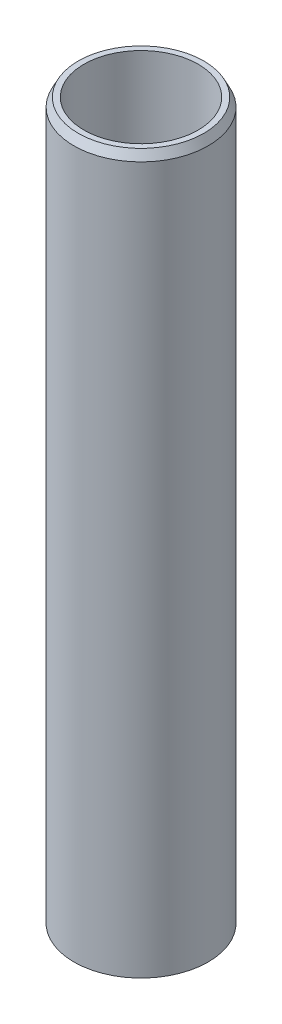
ISO-10303-21;
HEADER;
FILE_DESCRIPTION(('STEP AP214'),'2;1');
FILE_NAME('part.step','',(''),(''),'','','');
FILE_SCHEMA(('AUTOMOTIVE_DESIGN { 1 0 10303 214 1 1 1 1 }'));
ENDSEC;
DATA;
#1=APPLICATION_CONTEXT('core data for automotive mechanical design processes');
#2=APPLICATION_PROTOCOL_DEFINITION('international standard','automotive_design',2000,#1);
#3=PRODUCT_CONTEXT('',#1,'mechanical');
#4=PRODUCT('Part','Part','',(#3));
#5=PRODUCT_RELATED_PRODUCT_CATEGORY('part','',(#4));
#6=PRODUCT_DEFINITION_FORMATION('','',#4);
#7=PRODUCT_DEFINITION_CONTEXT('part definition',#1,'design');
#8=PRODUCT_DEFINITION('design','',#6,#7);
#9=PRODUCT_DEFINITION_SHAPE('','',#8);
#10=(LENGTH_UNIT() NAMED_UNIT(*) SI_UNIT(.MILLI.,.METRE.));
#11=(NAMED_UNIT(*) PLANE_ANGLE_UNIT() SI_UNIT($,.RADIAN.));
#12=(NAMED_UNIT(*) SI_UNIT($,.STERADIAN.) SOLID_ANGLE_UNIT());
#13=UNCERTAINTY_MEASURE_WITH_UNIT(LENGTH_MEASURE(1.E-05),#10,'distance_accuracy_value','');
#14=(GEOMETRIC_REPRESENTATION_CONTEXT(3) GLOBAL_UNCERTAINTY_ASSIGNED_CONTEXT((#13)) GLOBAL_UNIT_ASSIGNED_CONTEXT((#10,
#11,#12)) REPRESENTATION_CONTEXT('',''));
#15=CARTESIAN_POINT('',(0.,0.,0.));
#16=DIRECTION('',(0.,0.,1.));
#17=DIRECTION('',(1.,0.,0.));
#18=AXIS2_PLACEMENT_3D('',#15,#16,#17);
#19=CARTESIAN_POINT('',(0.,482.267406242049,0.));
#20=DIRECTION('',(0.,-1.,0.));
#21=DIRECTION('',(0.,0.,-1.));
#22=AXIS2_PLACEMENT_3D('',#19,#20,#21);
#23=CYLINDRICAL_SURFACE('',#22,45.);
#24=CARTESIAN_POINT('',(0.,476.4925328889,0.));
#25=DIRECTION('',(0.,1.,0.));
#26=DIRECTION('',(0.,0.,1.));
#27=AXIS2_PLACEMENT_3D('',#24,#25,#26);
#28=CIRCLE('',#27,45.);
#29=CARTESIAN_POINT('',(0.,476.4925328889,-45.));
#30=VERTEX_POINT('',#29);
#31=EDGE_CURVE('E50',#30,#30,#28,.F.);
#32=CARTESIAN_POINT('',(0.,2.95752745711164,0.));
#33=DIRECTION('',(0.,1.,0.));
#34=DIRECTION('',(0.,0.,1.));
#35=AXIS2_PLACEMENT_3D('',#32,#33,#34);
#36=CIRCLE('',#35,45.);
#37=CARTESIAN_POINT('',(0.,2.95752745711164,-45.));
#38=VERTEX_POINT('',#37);
#39=EDGE_CURVE('E51',#38,#38,#36,.T.);
#40=CARTESIAN_POINT('',(0.,476.4925328889,-45.));
#41=CARTESIAN_POINT('',(0.,471.559876582319,-45.));
#42=CARTESIAN_POINT('',(0.,466.627220275738,-45.));
#43=CARTESIAN_POINT('',(0.,456.761907662576,-45.));
#44=CARTESIAN_POINT('',(0.,451.829251355994,-45.));
#45=CARTESIAN_POINT('',(0.,441.963938742832,-45.));
#46=CARTESIAN_POINT('',(0.,437.031282436251,-45.));
#47=CARTESIAN_POINT('',(0.,427.165969823089,-45.));
#48=CARTESIAN_POINT('',(0.,422.233313516508,-45.));
#49=CARTESIAN_POINT('',(0.,412.368000903345,-45.));
#50=CARTESIAN_POINT('',(0.,407.435344596764,-45.));
#51=CARTESIAN_POINT('',(0.,397.570031983602,-45.));
#52=CARTESIAN_POINT('',(0.,392.637375677021,-45.));
#53=CARTESIAN_POINT('',(0.,382.772063063859,-45.));
#54=CARTESIAN_POINT('',(0.,377.839406757277,-45.));
#55=CARTESIAN_POINT('',(0.,367.974094144115,-45.));
#56=CARTESIAN_POINT('',(0.,363.041437837534,-45.));
#57=CARTESIAN_POINT('',(0.,353.176125224372,-45.));
#58=CARTESIAN_POINT('',(0.,348.243468917791,-45.));
#59=CARTESIAN_POINT('',(0.,338.378156304628,-45.));
#60=CARTESIAN_POINT('',(0.,333.445499998047,-45.));
#61=CARTESIAN_POINT('',(0.,323.580187384885,-45.));
#62=CARTESIAN_POINT('',(0.,318.647531078304,-45.));
#63=CARTESIAN_POINT('',(0.,308.782218465142,-45.));
#64=CARTESIAN_POINT('',(0.,303.849562158561,-45.));
#65=CARTESIAN_POINT('',(0.,293.984249545398,-45.));
#66=CARTESIAN_POINT('',(0.,289.051593238817,-45.));
#67=CARTESIAN_POINT('',(0.,279.186280625655,-45.));
#68=CARTESIAN_POINT('',(0.,274.253624319074,-45.));
#69=CARTESIAN_POINT('',(0.,264.388311705911,-45.));
#70=CARTESIAN_POINT('',(0.,259.45565539933,-45.));
#71=CARTESIAN_POINT('',(0.,249.590342786168,-45.));
#72=CARTESIAN_POINT('',(0.,244.657686479587,-45.));
#73=CARTESIAN_POINT('',(0.,234.792373866425,-45.));
#74=CARTESIAN_POINT('',(0.,229.859717559844,-45.));
#75=CARTESIAN_POINT('',(0.,219.994404946681,-45.));
#76=CARTESIAN_POINT('',(0.,215.0617486401,-45.));
#77=CARTESIAN_POINT('',(0.,205.196436026938,-45.));
#78=CARTESIAN_POINT('',(0.,200.263779720357,-45.));
#79=CARTESIAN_POINT('',(0.,190.398467107195,-45.));
#80=CARTESIAN_POINT('',(0.,185.465810800613,-45.));
#81=CARTESIAN_POINT('',(0.,175.600498187451,-45.));
#82=CARTESIAN_POINT('',(0.,170.66784188087,-45.));
#83=CARTESIAN_POINT('',(0.,160.802529267708,-45.));
#84=CARTESIAN_POINT('',(0.,155.869872961127,-45.));
#85=CARTESIAN_POINT('',(0.,146.004560347964,-45.));
#86=CARTESIAN_POINT('',(0.,141.071904041383,-45.));
#87=CARTESIAN_POINT('',(0.,131.206591428221,-45.));
#88=CARTESIAN_POINT('',(0.,126.27393512164,-45.));
#89=CARTESIAN_POINT('',(0.,116.408622508478,-45.));
#90=CARTESIAN_POINT('',(0.,111.475966201896,-45.));
#91=CARTESIAN_POINT('',(0.,101.610653588734,-45.));
#92=CARTESIAN_POINT('',(0.,96.6779972821531,-45.));
#93=CARTESIAN_POINT('',(0.,86.8126846689908,-45.));
#94=CARTESIAN_POINT('',(0.,81.8800283624097,-45.));
#95=CARTESIAN_POINT('',(0.,72.0147157492474,-45.));
#96=CARTESIAN_POINT('',(0.,67.0820594426663,-45.));
#97=CARTESIAN_POINT('',(0.,57.2167468295041,-45.));
#98=CARTESIAN_POINT('',(0.,52.2840905229229,-45.));
#99=CARTESIAN_POINT('',(0.,42.4187779097607,-45.));
#100=CARTESIAN_POINT('',(0.,37.4861216031795,-45.));
#101=CARTESIAN_POINT('',(0.,27.6208089900173,-45.));
#102=CARTESIAN_POINT('',(0.,22.6881526834362,-45.));
#103=CARTESIAN_POINT('',(0.,12.8228400702739,-45.));
#104=CARTESIAN_POINT('',(0.,7.89018376369277,-45.));
#105=CARTESIAN_POINT('',(0.,2.95752745711164,-45.));
#106=B_SPLINE_CURVE_WITH_KNOTS('',3,(#40,#41,#42,#43,#44,#45,#46,#47,#48,#49,#50,#51,#52,#53,
#54,#55,#56,#57,#58,#59,#60,#61,#62,#63,#64,#65,#66,#67,#68,#69,#70,#71,#72,#73,#74,#75,#76,#77,
#78,#79,#80,#81,#82,#83,#84,#85,#86,#87,#88,#89,#90,#91,#92,#93,#94,#95,#96,#97,#98,#99,#100,
#101,#102,#103,#104,#105),.UNSPECIFIED.,.F.,.F.,(4,2,2,2,2,2,2,2,2,2,2,2,2,2,2,2,2,2,2,2,2,2,2,
2,2,2,2,2,2,2,2,2,4),(0.,14.7979689197434,29.5959378394868,44.3939067592302,59.1918756789736,
73.989844598717,88.7878135184604,103.585782438204,118.383751357947,133.181720277691,
147.979689197434,162.777658117177,177.575627036921,192.373595956664,207.171564876407,
221.969533796151,236.767502715894,251.565471635638,266.363440555381,281.161409475124,
295.959378394868,310.757347314611,325.555316234355,340.353285154098,355.151254073841,
369.949222993585,384.747191913328,399.545160833072,414.343129752815,429.141098672558,
443.939067592302,458.737036512045,473.535005431788),.UNSPECIFIED.);
#107=EDGE_CURVE('BSEAM39',#30,#38,#106,.T.);
#108=ORIENTED_EDGE('',*,*,#31,.T.);
#109=ORIENTED_EDGE('',*,*,#39,.T.);
#110=ORIENTED_EDGE('',*,*,#107,.T.);
#111=ORIENTED_EDGE('',*,*,#107,.F.);
#112=EDGE_LOOP('',(#108,#110,#109,#111));
#113=FACE_BOUND('',#112,.T.);
#114=ADVANCED_FACE('F39',(#113),#23,.T.);
#115=CARTESIAN_POINT('',(0.,482.267406242049,0.));
#116=DIRECTION('',(0.,1.,0.));
#117=DIRECTION('',(0.,0.,1.));
#118=AXIS2_PLACEMENT_3D('',#115,#116,#117);
#119=PLANE('',#118);
#120=CARTESIAN_POINT('',(0.,482.267406242049,0.));
#121=DIRECTION('',(0.,1.,0.));
#122=DIRECTION('',(0.,0.,1.));
#123=AXIS2_PLACEMENT_3D('',#120,#121,#122);
#124=CIRCLE('',#123,42.0424725428887);
#125=CARTESIAN_POINT('',(0.,482.267406242049,42.0424725428887));
#126=VERTEX_POINT('',#125);
#127=EDGE_CURVE('E54',#126,#126,#124,.T.);
#128=ORIENTED_EDGE('',*,*,#127,.T.);
#129=EDGE_LOOP('',(#128));
#130=FACE_BOUND('',#129,.T.);
#131=CARTESIAN_POINT('',(0.,482.267406242049,0.));
#132=DIRECTION('',(0.,1.,0.));
#133=DIRECTION('',(0.,0.,1.));
#134=AXIS2_PLACEMENT_3D('',#131,#132,#133);
#135=CIRCLE('',#134,38.2643861408884);
#136=CARTESIAN_POINT('',(0.,482.267406242049,-38.2643861408884));
#137=VERTEX_POINT('',#136);
#138=EDGE_CURVE('E58',#137,#137,#135,.T.);
#139=ORIENTED_EDGE('',*,*,#138,.F.);
#140=EDGE_LOOP('',(#139));
#141=FACE_BOUND('',#140,.T.);
#142=ADVANCED_FACE('F69',(#130,#141),#119,.T.);
#143=CARTESIAN_POINT('',(0.,0.,0.));
#144=DIRECTION('',(0.,1.,0.));
#145=DIRECTION('',(0.,0.,1.));
#146=AXIS2_PLACEMENT_3D('',#143,#144,#145);
#147=PLANE('',#146);
#148=CARTESIAN_POINT('',(0.,0.,0.));
#149=DIRECTION('',(0.,1.,0.));
#150=DIRECTION('',(0.,0.,1.));
#151=AXIS2_PLACEMENT_3D('',#148,#149,#150);
#152=CIRCLE('',#151,39.2251266468508);
#153=CARTESIAN_POINT('',(0.,0.,39.2251266468508));
#154=VERTEX_POINT('',#153);
#155=EDGE_CURVE('E10',#154,#154,#152,.F.);
#156=ORIENTED_EDGE('',*,*,#155,.T.);
#157=EDGE_LOOP('',(#156));
#158=FACE_BOUND('',#157,.T.);
#159=CARTESIAN_POINT('',(0.,0.,0.));
#160=DIRECTION('',(0.,1.,0.));
#161=DIRECTION('',(0.,0.,1.));
#162=AXIS2_PLACEMENT_3D('',#159,#160,#161);
#163=CIRCLE('',#162,38.2643861408884);
#164=CARTESIAN_POINT('',(0.,0.,-38.2643861408884));
#165=VERTEX_POINT('',#164);
#166=EDGE_CURVE('E63',#165,#165,#163,.T.);
#167=ORIENTED_EDGE('',*,*,#166,.T.);
#168=EDGE_LOOP('',(#167));
#169=FACE_BOUND('',#168,.T.);
#170=ADVANCED_FACE('F75',(#158,#169),#147,.F.);
#171=CARTESIAN_POINT('',(0.,482.267406242049,0.));
#172=DIRECTION('',(0.,-1.,0.));
#173=DIRECTION('',(0.,0.,-1.));
#174=AXIS2_PLACEMENT_3D('',#171,#172,#173);
#175=CYLINDRICAL_SURFACE('',#174,38.2643861408884);
#176=CARTESIAN_POINT('',(0.,482.267406242049,-38.2643861408884));
#177=CARTESIAN_POINT('',(0.,477.243787427027,-38.2643861408884));
#178=CARTESIAN_POINT('',(0.,472.220168612006,-38.2643861408884));
#179=CARTESIAN_POINT('',(0.,462.172930981963,-38.2643861408884));
#180=CARTESIAN_POINT('',(0.,457.149312166942,-38.2643861408884));
#181=CARTESIAN_POINT('',(0.,447.102074536899,-38.2643861408884));
#182=CARTESIAN_POINT('',(0.,442.078455721878,-38.2643861408884));
#183=CARTESIAN_POINT('',(0.,432.031218091835,-38.2643861408884));
#184=CARTESIAN_POINT('',(0.,427.007599276814,-38.2643861408884));
#185=CARTESIAN_POINT('',(0.,416.960361646771,-38.2643861408884));
#186=CARTESIAN_POINT('',(0.,411.93674283175,-38.2643861408884));
#187=CARTESIAN_POINT('',(0.,401.889505201707,-38.2643861408884));
#188=CARTESIAN_POINT('',(0.,396.865886386686,-38.2643861408884));
#189=CARTESIAN_POINT('',(0.,386.818648756643,-38.2643861408884));
#190=CARTESIAN_POINT('',(0.,381.795029941622,-38.2643861408884));
#191=CARTESIAN_POINT('',(0.,371.747792311579,-38.2643861408884));
#192=CARTESIAN_POINT('',(0.,366.724173496558,-38.2643861408884));
#193=CARTESIAN_POINT('',(0.,356.676935866515,-38.2643861408884));
#194=CARTESIAN_POINT('',(0.,351.653317051494,-38.2643861408884));
#195=CARTESIAN_POINT('',(0.,341.606079421451,-38.2643861408884));
#196=CARTESIAN_POINT('',(0.,336.58246060643,-38.2643861408884));
#197=CARTESIAN_POINT('',(0.,326.535222976387,-38.2643861408884));
#198=CARTESIAN_POINT('',(0.,321.511604161366,-38.2643861408884));
#199=CARTESIAN_POINT('',(0.,311.464366531323,-38.2643861408884));
#200=CARTESIAN_POINT('',(0.,306.440747716302,-38.2643861408884));
#201=CARTESIAN_POINT('',(0.,296.393510086259,-38.2643861408884));
#202=CARTESIAN_POINT('',(0.,291.369891271238,-38.2643861408884));
#203=CARTESIAN_POINT('',(0.,281.322653641195,-38.2643861408884));
#204=CARTESIAN_POINT('',(0.,276.299034826174,-38.2643861408884));
#205=CARTESIAN_POINT('',(0.,266.251797196131,-38.2643861408884));
#206=CARTESIAN_POINT('',(0.,261.22817838111,-38.2643861408884));
#207=CARTESIAN_POINT('',(0.,251.180940751067,-38.2643861408884));
#208=CARTESIAN_POINT('',(0.,246.157321936046,-38.2643861408884));
#209=CARTESIAN_POINT('',(0.,236.110084306003,-38.2643861408884));
#210=CARTESIAN_POINT('',(0.,231.086465490982,-38.2643861408884));
#211=CARTESIAN_POINT('',(0.,221.039227860939,-38.2643861408884));
#212=CARTESIAN_POINT('',(0.,216.015609045918,-38.2643861408884));
#213=CARTESIAN_POINT('',(0.,205.968371415875,-38.2643861408884));
#214=CARTESIAN_POINT('',(0.,200.944752600854,-38.2643861408884));
#215=CARTESIAN_POINT('',(0.,190.897514970811,-38.2643861408884));
#216=CARTESIAN_POINT('',(0.,185.87389615579,-38.2643861408884));
#217=CARTESIAN_POINT('',(0.,175.826658525747,-38.2643861408884));
#218=CARTESIAN_POINT('',(0.,170.803039710726,-38.2643861408884));
#219=CARTESIAN_POINT('',(0.,160.755802080683,-38.2643861408884));
#220=CARTESIAN_POINT('',(0.,155.732183265662,-38.2643861408884));
#221=CARTESIAN_POINT('',(0.,145.684945635619,-38.2643861408884));
#222=CARTESIAN_POINT('',(0.,140.661326820598,-38.2643861408884));
#223=CARTESIAN_POINT('',(0.,130.614089190555,-38.2643861408884));
#224=CARTESIAN_POINT('',(0.,125.590470375533,-38.2643861408884));
#225=CARTESIAN_POINT('',(0.,115.543232745491,-38.2643861408884));
#226=CARTESIAN_POINT('',(0.,110.519613930469,-38.2643861408884));
#227=CARTESIAN_POINT('',(0.,100.472376300427,-38.2643861408884));
#228=CARTESIAN_POINT('',(0.,95.4487574854055,-38.2643861408884));
#229=CARTESIAN_POINT('',(0.,85.4015198553628,-38.2643861408884));
#230=CARTESIAN_POINT('',(0.,80.3779010403414,-38.2643861408884));
#231=CARTESIAN_POINT('',(0.,70.3306634102988,-38.2643861408884));
#232=CARTESIAN_POINT('',(0.,65.3070445952774,-38.2643861408884));
#233=CARTESIAN_POINT('',(0.,55.2598069652347,-38.2643861408884));
#234=CARTESIAN_POINT('',(0.,50.2361881502134,-38.2643861408884));
#235=CARTESIAN_POINT('',(0.,40.1889505201707,-38.2643861408884));
#236=CARTESIAN_POINT('',(0.,35.1653317051494,-38.2643861408884));
#237=CARTESIAN_POINT('',(0.,25.1180940751067,-38.2643861408884));
#238=CARTESIAN_POINT('',(0.,20.0944752600853,-38.2643861408884));
#239=CARTESIAN_POINT('',(0.,10.0472376300427,-38.2643861408884));
#240=CARTESIAN_POINT('',(0.,5.02361881502133,-38.2643861408884));
#241=CARTESIAN_POINT('',(0.,0.,-38.2643861408884));
#242=B_SPLINE_CURVE_WITH_KNOTS('',3,(#176,#177,#178,#179,#180,#181,#182,#183,#184,#185,#186,
#187,#188,#189,#190,#191,#192,#193,#194,#195,#196,#197,#198,#199,#200,#201,#202,#203,#204,#205,
#206,#207,#208,#209,#210,#211,#212,#213,#214,#215,#216,#217,#218,#219,#220,#221,#222,#223,#224,
#225,#226,#227,#228,#229,#230,#231,#232,#233,#234,#235,#236,#237,#238,#239,#240,#241),
.UNSPECIFIED.,.F.,.F.,(4,2,2,2,2,2,2,2,2,2,2,2,2,2,2,2,2,2,2,2,2,2,2,2,2,2,2,2,2,2,2,2,4),(0.,
15.070856445064,30.141712890128,45.212569335192,60.283425780256,75.35428222532,90.425138670384,
105.495995115448,120.566851560512,135.637708005576,150.70856445064,165.779420895704,
180.850277340768,195.921133785832,210.991990230896,226.06284667596,241.133703121024,
256.204559566088,271.275416011152,286.346272456216,301.41712890128,316.487985346344,
331.558841791408,346.629698236472,361.700554681536,376.7714111266,391.842267571664,
406.913124016728,421.983980461792,437.054836906857,452.125693351921,467.196549796985,
482.267406242049),.UNSPECIFIED.);
#243=EDGE_CURVE('BSEAM70',#137,#165,#242,.T.);
#244=ORIENTED_EDGE('',*,*,#138,.T.);
#245=ORIENTED_EDGE('',*,*,#166,.F.);
#246=ORIENTED_EDGE('',*,*,#243,.T.);
#247=ORIENTED_EDGE('',*,*,#243,.F.);
#248=EDGE_LOOP('',(#244,#246,#245,#247));
#249=FACE_BOUND('',#248,.T.);
#250=ADVANCED_FACE('F70',(#249),#175,.F.);
#251=CARTESIAN_POINT('',(0.,482.267406242049,0.));
#252=DIRECTION('',(0.,-1.,0.));
#253=DIRECTION('',(0.,0.,-1.));
#254=AXIS2_PLACEMENT_3D('',#251,#252,#253);
#255=CONICAL_SURFACE('',#254,42.0424725428887,0.47331015461717);
#256=ORIENTED_EDGE('',*,*,#31,.F.);
#257=EDGE_LOOP('',(#256));
#258=FACE_BOUND('',#257,.T.);
#259=ORIENTED_EDGE('',*,*,#127,.F.);
#260=EDGE_LOOP('',(#259));
#261=FACE_BOUND('',#260,.T.);
#262=ADVANCED_FACE('F81',(#258,#261),#255,.T.);
#263=CARTESIAN_POINT('',(0.,2.95752745711164,0.));
#264=DIRECTION('',(0.,1.,0.));
#265=DIRECTION('',(0.,0.,1.));
#266=AXIS2_PLACEMENT_3D('',#263,#264,#265);
#267=CONICAL_SURFACE('',#266,45.,1.09748617217773);
#268=ORIENTED_EDGE('',*,*,#155,.F.);
#269=EDGE_LOOP('',(#268));
#270=FACE_BOUND('',#269,.T.);
#271=ORIENTED_EDGE('',*,*,#39,.F.);
#272=EDGE_LOOP('',(#271));
#273=FACE_BOUND('',#272,.T.);
#274=ADVANCED_FACE('F45',(#270,#273),#267,.T.);
#275=CLOSED_SHELL('',(#114,#142,#170,#250,#262,#274));
#276=MANIFOLD_SOLID_BREP('B2',#275);
#277=ADVANCED_BREP_SHAPE_REPRESENTATION('',(#18,#276),#14);
#278=SHAPE_DEFINITION_REPRESENTATION(#9,#277);
ENDSEC;
END-ISO-10303-21;
